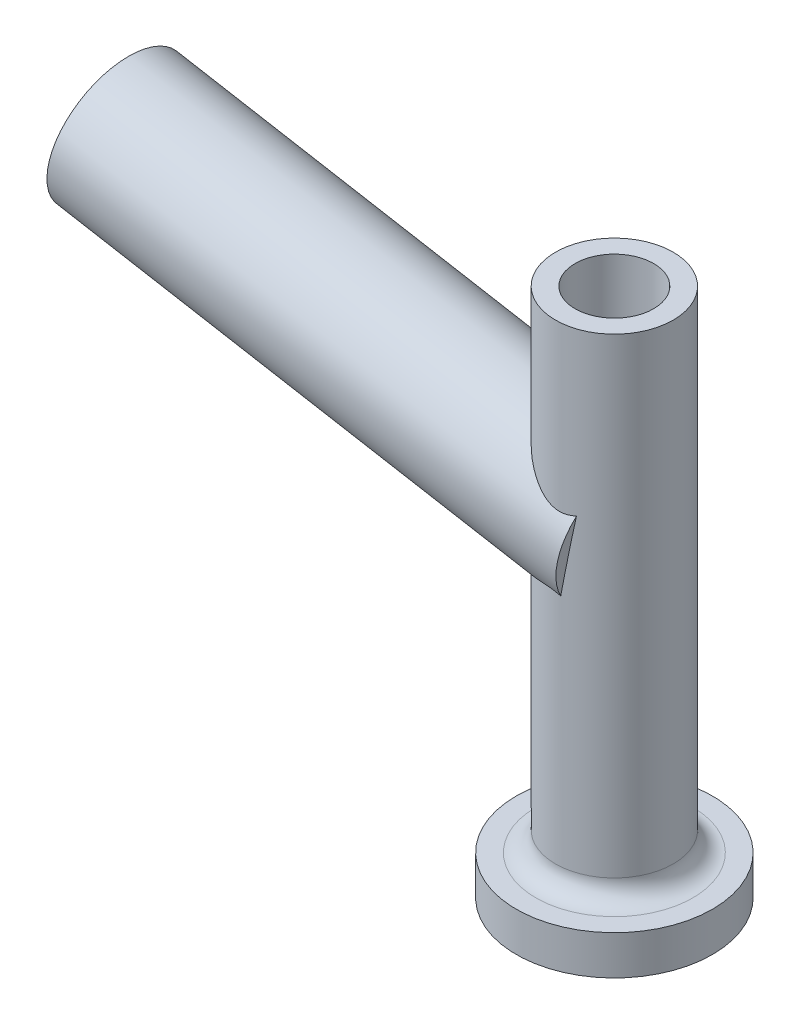
ISO-10303-21;
HEADER;
FILE_DESCRIPTION(('STEP AP214'),'2;1');
FILE_NAME('part.step','',(''),(''),'','','');
FILE_SCHEMA(('AUTOMOTIVE_DESIGN { 1 0 10303 214 1 1 1 1 }'));
ENDSEC;
DATA;
#1=APPLICATION_CONTEXT('core data for automotive mechanical design processes');
#2=APPLICATION_PROTOCOL_DEFINITION('international standard','automotive_design',2000,#1);
#3=PRODUCT_CONTEXT('',#1,'mechanical');
#4=PRODUCT('Part','Part','',(#3));
#5=PRODUCT_RELATED_PRODUCT_CATEGORY('part','',(#4));
#6=PRODUCT_DEFINITION_FORMATION('','',#4);
#7=PRODUCT_DEFINITION_CONTEXT('part definition',#1,'design');
#8=PRODUCT_DEFINITION('design','',#6,#7);
#9=PRODUCT_DEFINITION_SHAPE('','',#8);
#10=(LENGTH_UNIT() NAMED_UNIT(*) SI_UNIT(.MILLI.,.METRE.));
#11=(NAMED_UNIT(*) PLANE_ANGLE_UNIT() SI_UNIT($,.RADIAN.));
#12=(NAMED_UNIT(*) SI_UNIT($,.STERADIAN.) SOLID_ANGLE_UNIT());
#13=UNCERTAINTY_MEASURE_WITH_UNIT(LENGTH_MEASURE(1.E-05),#10,'distance_accuracy_value','');
#14=(GEOMETRIC_REPRESENTATION_CONTEXT(3) GLOBAL_UNCERTAINTY_ASSIGNED_CONTEXT((#13)) GLOBAL_UNIT_ASSIGNED_CONTEXT((#10,
#11,#12)) REPRESENTATION_CONTEXT('',''));
#15=CARTESIAN_POINT('',(0.,0.,0.));
#16=DIRECTION('',(0.,0.,1.));
#17=DIRECTION('',(1.,0.,0.));
#18=AXIS2_PLACEMENT_3D('',#15,#16,#17);
#19=CARTESIAN_POINT('',(50.,-115.,0.));
#20=DIRECTION('',(0.,1.,0.));
#21=DIRECTION('',(-1.,0.,0.));
#22=AXIS2_PLACEMENT_3D('',#19,#20,#21);
#23=PLANE('',#22);
#24=CARTESIAN_POINT('',(0.,-115.,0.));
#25=DIRECTION('',(0.,1.,0.));
#26=DIRECTION('',(-1.,0.,0.));
#27=AXIS2_PLACEMENT_3D('',#24,#25,#26);
#28=CIRCLE('',#27,40.);
#29=CARTESIAN_POINT('',(-40.,-115.,0.));
#30=VERTEX_POINT('',#29);
#31=EDGE_CURVE('E42',#30,#30,#28,.F.);
#32=ORIENTED_EDGE('',*,*,#31,.T.);
#33=EDGE_LOOP('',(#32));
#34=FACE_BOUND('',#33,.T.);
#35=CARTESIAN_POINT('',(0.,-115.,0.));
#36=DIRECTION('',(0.,-1.,0.));
#37=DIRECTION('',(1.,0.,0.));
#38=AXIS2_PLACEMENT_3D('',#35,#36,#37);
#39=CIRCLE('',#38,50.);
#40=CARTESIAN_POINT('',(50.,-115.,0.));
#41=VERTEX_POINT('',#40);
#42=EDGE_CURVE('E72',#41,#41,#39,.T.);
#43=ORIENTED_EDGE('',*,*,#42,.F.);
#44=EDGE_LOOP('',(#43));
#45=FACE_BOUND('',#44,.T.);
#46=ADVANCED_FACE('F34',(#34,#45),#23,.T.);
#47=CARTESIAN_POINT('',(0.,-135.,0.));
#48=DIRECTION('',(0.,-1.,0.));
#49=DIRECTION('',(1.,0.,0.));
#50=AXIS2_PLACEMENT_3D('',#47,#48,#49);
#51=CYLINDRICAL_SURFACE('',#50,50.);
#52=ORIENTED_EDGE('',*,*,#42,.T.);
#53=EDGE_LOOP('',(#52));
#54=FACE_BOUND('',#53,.T.);
#55=CARTESIAN_POINT('',(0.,-135.,0.));
#56=DIRECTION('',(0.,-1.,0.));
#57=DIRECTION('',(1.,0.,0.));
#58=AXIS2_PLACEMENT_3D('',#55,#56,#57);
#59=CIRCLE('',#58,50.);
#60=CARTESIAN_POINT('',(50.,-135.,0.));
#61=VERTEX_POINT('',#60);
#62=EDGE_CURVE('E89',#61,#61,#59,.T.);
#63=ORIENTED_EDGE('',*,*,#62,.F.);
#64=EDGE_LOOP('',(#63));
#65=FACE_BOUND('',#64,.T.);
#66=ADVANCED_FACE('F119',(#54,#65),#51,.T.);
#67=CARTESIAN_POINT('',(20.,-135.,0.));
#68=DIRECTION('',(0.,-1.,0.));
#69=DIRECTION('',(1.,0.,0.));
#70=AXIS2_PLACEMENT_3D('',#67,#68,#69);
#71=PLANE('',#70);
#72=ORIENTED_EDGE('',*,*,#62,.T.);
#73=EDGE_LOOP('',(#72));
#74=FACE_BOUND('',#73,.T.);
#75=CARTESIAN_POINT('',(0.,-135.,0.));
#76=DIRECTION('',(0.,-1.,0.));
#77=DIRECTION('',(1.,0.,0.));
#78=AXIS2_PLACEMENT_3D('',#75,#76,#77);
#79=CIRCLE('',#78,20.);
#80=CARTESIAN_POINT('',(20.,-135.,0.));
#81=VERTEX_POINT('',#80);
#82=EDGE_CURVE('E86',#81,#81,#79,.T.);
#83=ORIENTED_EDGE('',*,*,#82,.F.);
#84=EDGE_LOOP('',(#83));
#85=FACE_BOUND('',#84,.T.);
#86=ADVANCED_FACE('F124',(#74,#85),#71,.T.);
#87=CARTESIAN_POINT('',(0.,-135.,0.));
#88=DIRECTION('',(0.,-1.,0.));
#89=DIRECTION('',(1.,0.,0.));
#90=AXIS2_PLACEMENT_3D('',#87,#88,#89);
#91=CYLINDRICAL_SURFACE('',#90,20.);
#92=ORIENTED_EDGE('',*,*,#82,.T.);
#93=EDGE_LOOP('',(#92));
#94=FACE_BOUND('',#93,.T.);
#95=CARTESIAN_POINT('',(0.,135.,0.));
#96=DIRECTION('',(0.,-1.,0.));
#97=DIRECTION('',(1.,0.,0.));
#98=AXIS2_PLACEMENT_3D('',#95,#96,#97);
#99=CIRCLE('',#98,20.);
#100=CARTESIAN_POINT('',(20.,135.,0.));
#101=VERTEX_POINT('',#100);
#102=EDGE_CURVE('E83',#101,#101,#99,.T.);
#103=ORIENTED_EDGE('',*,*,#102,.F.);
#104=EDGE_LOOP('',(#103));
#105=FACE_BOUND('',#104,.T.);
#106=ADVANCED_FACE('F132',(#94,#105),#91,.F.);
#107=CARTESIAN_POINT('',(29.9999999999999,135.,0.));
#108=DIRECTION('',(0.,1.,0.));
#109=DIRECTION('',(-1.,0.,0.));
#110=AXIS2_PLACEMENT_3D('',#107,#108,#109);
#111=PLANE('',#110);
#112=ORIENTED_EDGE('',*,*,#102,.T.);
#113=EDGE_LOOP('',(#112));
#114=FACE_BOUND('',#113,.T.);
#115=CARTESIAN_POINT('',(0.,135.,0.));
#116=DIRECTION('',(0.,-1.,0.));
#117=DIRECTION('',(1.,0.,0.));
#118=AXIS2_PLACEMENT_3D('',#115,#116,#117);
#119=CIRCLE('',#118,30.);
#120=CARTESIAN_POINT('',(29.9999999999999,135.,0.));
#121=VERTEX_POINT('',#120);
#122=EDGE_CURVE('E80',#121,#121,#119,.T.);
#123=ORIENTED_EDGE('',*,*,#122,.F.);
#124=EDGE_LOOP('',(#123));
#125=FACE_BOUND('',#124,.T.);
#126=ADVANCED_FACE('F135',(#114,#125),#111,.T.);
#127=CARTESIAN_POINT('',(0.,-135.,0.));
#128=DIRECTION('',(0.,-1.,0.));
#129=DIRECTION('',(1.,0.,0.));
#130=AXIS2_PLACEMENT_3D('',#127,#128,#129);
#131=CYLINDRICAL_SURFACE('',#130,30.);
#132=CARTESIAN_POINT('',(0.,-105.,0.));
#133=DIRECTION('',(0.,1.,0.));
#134=DIRECTION('',(-1.,0.,0.));
#135=AXIS2_PLACEMENT_3D('',#132,#133,#134);
#136=CIRCLE('',#135,30.);
#137=CARTESIAN_POINT('',(-30.,-105.,0.));
#138=VERTEX_POINT('',#137);
#139=EDGE_CURVE('E11',#138,#138,#136,.T.);
#140=ORIENTED_EDGE('',*,*,#139,.T.);
#141=EDGE_LOOP('',(#140));
#142=FACE_BOUND('',#141,.T.);
#143=CARTESIAN_POINT('',(0.,2.19269047363468E-12,0.));
#144=DIRECTION('',(0.984807753012208,-0.173648177666931,0.));
#145=DIRECTION('',(-0.173648177666931,-0.984807753012208,0.));
#146=AXIS2_PLACEMENT_3D('',#143,#144,#145);
#147=ELLIPSE('',#146,172.763114494308,30.);
#148=CARTESIAN_POINT('',(2.55965773767558,14.5165403921261,29.8906030763173));
#149=VERTEX_POINT('',#148);
#150=CARTESIAN_POINT('',(9.23920533264113,52.3981372307253,28.5418479573641));
#151=VERTEX_POINT('',#150);
#152=EDGE_CURVE('E49',#149,#151,#147,.F.);
#153=ORIENTED_EDGE('',*,*,#152,.F.);
#154=CARTESIAN_POINT('',(2.55965773767559,14.5165403921261,-29.8906030763174));
#155=CARTESIAN_POINT('',(2.34275392169348,14.5857519527365,-29.909177651239));
#156=CARTESIAN_POINT('',(2.12456736897599,14.6515050381402,-29.9254826695436));
#157=CARTESIAN_POINT('',(1.68579412105829,14.7756972704318,-29.9534046391235));
#158=CARTESIAN_POINT('',(1.46520708638688,14.8341353678468,-29.9650209182415));
#159=CARTESIAN_POINT('',(0.800122180655471,14.9978691687799,-29.9926088052968));
#160=CARTESIAN_POINT('',(0.352364237312519,15.0915638436472,-30.0013139263609));
#161=CARTESIAN_POINT('',(-0.54455985538153,15.2447559866207,-29.9983783919114));
#162=CARTESIAN_POINT('',(-0.993673359321253,15.3045661155237,-29.986927897652));
#163=CARTESIAN_POINT('',(-1.89403704029497,15.3903300467166,-29.9435412201925));
#164=CARTESIAN_POINT('',(-2.34528662719881,15.4162927080262,-29.9116104006475));
#165=CARTESIAN_POINT('',(-3.24759427537743,15.4349801083142,-29.827151592793));
#166=CARTESIAN_POINT('',(-3.69864931647299,15.4276254758366,-29.7745746916921));
#167=CARTESIAN_POINT('',(-4.5963339099502,15.3815487663667,-29.6492694560147));
#168=CARTESIAN_POINT('',(-5.04296286722682,15.3428225277348,-29.5765384487121));
#169=CARTESIAN_POINT('',(-5.92992396512372,15.2370183332403,-29.4115599717506));
#170=CARTESIAN_POINT('',(-6.37024424267686,15.1698927694899,-29.3192798607759));
#171=CARTESIAN_POINT('',(-7.24201358936005,15.0109526417834,-29.116209670304));
#172=CARTESIAN_POINT('',(-7.6734617817988,14.9191356504543,-29.0054177713494));
#173=CARTESIAN_POINT('',(-8.7845266900506,14.6526771136064,-28.6938574838978));
#174=CARTESIAN_POINT('',(-9.45633157155368,14.4615374309695,-28.479211230583));
#175=CARTESIAN_POINT('',(-10.7723057479621,14.0397757734529,-28.007975219263));
#176=CARTESIAN_POINT('',(-11.4164574502491,13.8091291169411,-27.7513592456011));
#177=CARTESIAN_POINT('',(-12.6788905632944,13.3195009065608,-27.1978373766482));
#178=CARTESIAN_POINT('',(-13.2970738885547,13.0604233151393,-26.9007940555545));
#179=CARTESIAN_POINT('',(-14.5054856304438,12.5242062555653,-26.2689123966115));
#180=CARTESIAN_POINT('',(-15.0957166182651,12.2470684542731,-25.9340775446352));
#181=CARTESIAN_POINT('',(-16.0621670580194,11.7736171754143,-25.3419803099595));
#182=CARTESIAN_POINT('',(-16.4458980310562,11.5801320807145,-25.0946248511082));
#183=CARTESIAN_POINT('',(-17.2007083151735,11.1903008827863,-24.5833972651538));
#184=CARTESIAN_POINT('',(-17.5717868675423,10.9939546089896,-24.319524150239));
#185=CARTESIAN_POINT('',(-18.6660966289599,10.4032012479736,-23.5033066331384));
#186=CARTESIAN_POINT('',(-19.3703430545544,10.0071090093245,-22.926400188155));
#187=CARTESIAN_POINT('',(-20.7247899311287,9.22323453252023,-21.7096873739858));
#188=CARTESIAN_POINT('',(-21.3750707152271,8.83544060426625,-21.0699777093307));
#189=CARTESIAN_POINT('',(-22.6192415922099,8.07768178424971,-19.7283125107));
#190=CARTESIAN_POINT('',(-23.2131476484242,7.70771186006011,-19.0263747070671));
#191=CARTESIAN_POINT('',(-24.2425920648423,7.05625795244201,-17.6884467011286));
#192=CARTESIAN_POINT('',(-24.6877838130943,6.77051285048002,-17.0619395945014));
#193=CARTESIAN_POINT('',(-25.5328345263628,6.22247215641581,-15.7692878213312));
#194=CARTESIAN_POINT('',(-25.9326972766204,5.96017460669069,-15.1031464715777));
#195=CARTESIAN_POINT('',(-26.6831569574515,5.46389221480842,-13.7338416407554));
#196=CARTESIAN_POINT('',(-27.0337707892959,5.22989766346037,-13.0306909750058));
#197=CARTESIAN_POINT('',(-27.6818493652197,4.79467244365067,-11.5904566649133));
#198=CARTESIAN_POINT('',(-27.9793136768305,4.59344204178656,-10.8533727445225));
#199=CARTESIAN_POINT('',(-28.5190910778352,4.22658778772996,-9.34391161804887));
#200=CARTESIAN_POINT('',(-28.7609660457036,4.06124732868361,-8.57130803483635));
#201=CARTESIAN_POINT('',(-29.1828031920545,3.77194435250767,-7.0017329822543));
#202=CARTESIAN_POINT('',(-29.362764658364,3.64798231134243,-6.20476123269969));
#203=CARTESIAN_POINT('',(-29.6575019893387,3.44455469722016,-4.5937629791386));
#204=CARTESIAN_POINT('',(-29.7723199484644,3.36506039055088,-3.77974784170473));
#205=CARTESIAN_POINT('',(-29.9347495579476,3.2525126246431,-2.14189475343983));
#206=CARTESIAN_POINT('',(-29.9823704010116,3.21945281307113,-1.31805816175768));
#207=CARTESIAN_POINT('',(-30.0077643449285,3.20182761760884,0.224929415890307));
#208=CARTESIAN_POINT('',(-29.9937432387295,3.21156500700368,0.943898027768025));
#209=CARTESIAN_POINT('',(-29.9142524406048,3.26670687722616,2.37755552613848));
#210=CARTESIAN_POINT('',(-29.8487879631648,3.31210774307494,3.09224483899848));
#211=CARTESIAN_POINT('',(-29.6673872629731,3.4376658702982,4.51202281033168));
#212=CARTESIAN_POINT('',(-29.5514538693189,3.51782118346814,5.21711200466696));
#213=CARTESIAN_POINT('',(-29.2707533171613,3.71133786872866,6.61284749284651));
#214=CARTESIAN_POINT('',(-29.1059849292763,3.82470007677519,7.30349342262461));
#215=CARTESIAN_POINT('',(-28.7335609598204,4.07994718764055,8.65229326910467));
#216=CARTESIAN_POINT('',(-28.5268313059952,4.22121477068779,9.31082099009673));
#217=CARTESIAN_POINT('',(-28.0709475707518,4.53125392397726,10.6062929127118));
#218=CARTESIAN_POINT('',(-27.8217946118659,4.70002476647059,11.243237684891));
#219=CARTESIAN_POINT('',(-27.2836153930004,5.06242262085783,12.4926799968597));
#220=CARTESIAN_POINT('',(-26.9945895127262,5.25604939605035,13.1051777693835));
#221=CARTESIAN_POINT('',(-26.3792408505676,5.66531900066874,14.3034747396341));
#222=CARTESIAN_POINT('',(-26.0529158938723,5.88096311378929,14.8892723777579));
#223=CARTESIAN_POINT('',(-25.3256200131976,6.35739238272472,16.0986610825595));
#224=CARTESIAN_POINT('',(-24.9203810563456,6.62051280840613,16.7187661193767));
#225=CARTESIAN_POINT('',(-24.0697663958042,7.16617177084114,17.9217513801782));
#226=CARTESIAN_POINT('',(-23.6243877514994,7.44871172990045,18.504628871536));
#227=CARTESIAN_POINT('',(-22.6956930037855,8.02911570437736,19.6326248288753));
#228=CARTESIAN_POINT('',(-22.2123284892749,8.32699910212691,20.177693388456));
#229=CARTESIAN_POINT('',(-21.210468777782,8.93302006975861,21.2283529998026));
#230=CARTESIAN_POINT('',(-20.691972933274,9.24115782859145,21.7339433235527));
#231=CARTESIAN_POINT('',(-19.5245860839281,9.91889298787042,22.7929651256536));
#232=CARTESIAN_POINT('',(-18.8690882249983,10.2895124935988,23.3384728127331));
#233=CARTESIAN_POINT('',(-17.5129310180261,11.0285307315678,24.3726231292356));
#234=CARTESIAN_POINT('',(-16.8122560292442,11.3969286458782,24.86124589853));
#235=CARTESIAN_POINT('',(-15.7283181585322,11.9386596692356,25.5500103790876));
#236=CARTESIAN_POINT('',(-15.3615908962499,12.1173927192744,25.7721988403599));
#237=CARTESIAN_POINT('',(-14.6170170616553,12.4694830381852,26.2016702180886));
#238=CARTESIAN_POINT('',(-14.2391717497089,12.6428409118577,26.408954814975));
#239=CARTESIAN_POINT('',(-13.472516853617,12.9820535045967,26.8081694481222));
#240=CARTESIAN_POINT('',(-13.0837145461231,13.1479130212659,27.0001093644102));
#241=CARTESIAN_POINT('',(-12.2947547739345,13.4699180919555,27.3683860624108));
#242=CARTESIAN_POINT('',(-11.8945955109559,13.6260620949641,27.5447203546862));
#243=CARTESIAN_POINT('',(-11.0217377962944,13.9484896453028,27.9065740483924));
#244=CARTESIAN_POINT('',(-10.5471955670056,14.1127550650689,28.0894729479701));
#245=CARTESIAN_POINT('',(-9.58337923263311,14.4198987985196,28.4327347079322));
#246=CARTESIAN_POINT('',(-9.09411004708015,14.5627841610188,28.5931049947285));
#247=CARTESIAN_POINT('',(-8.10256871923214,14.8213559375595,28.8897119271294));
#248=CARTESIAN_POINT('',(-7.60033171649036,14.9371087252985,29.0260072608322));
#249=CARTESIAN_POINT('',(-6.58327215973041,15.1358221897546,29.2734385441179));
#250=CARTESIAN_POINT('',(-6.06845214570717,15.2187894274221,29.3845795256138));
#251=CARTESIAN_POINT('',(-5.1065050021965,15.3365129156905,29.5656243358989));
#252=CARTESIAN_POINT('',(-4.66072817048052,15.3766125691506,29.6392057230148));
#253=CARTESIAN_POINT('',(-3.76456840993162,15.4256507193608,29.7663022500651));
#254=CARTESIAN_POINT('',(-3.31418568407967,15.4345905834329,29.8198182703955));
#255=CARTESIAN_POINT('',(-2.41200664055168,15.4191973287807,29.9063127064611));
#256=CARTESIAN_POINT('',(-1.96021039973206,15.3948659887728,29.9392922199642));
#257=CARTESIAN_POINT('',(-1.05883473537718,15.3123006683053,29.9847043628817));
#258=CARTESIAN_POINT('',(-0.609254727401835,15.2540761678498,29.9971427339751));
#259=CARTESIAN_POINT('',(0.299369607931564,15.1021662412201,30.0020588311388));
#260=CARTESIAN_POINT('',(0.758232384978755,15.0073673478396,29.9938599288144));
#261=CARTESIAN_POINT('',(1.43949713700399,14.8408322410306,29.9663066346198));
#262=CARTESIAN_POINT('',(1.66530391723962,14.7812998469639,29.9545892694805));
#263=CARTESIAN_POINT('',(2.11440697382146,14.6545649002411,29.9262405977777));
#264=CARTESIAN_POINT('',(2.33770364181606,14.587363562929,29.9096100691712));
#265=CARTESIAN_POINT('',(2.5596577376756,14.5165403921262,29.8906030763174));
#266=B_SPLINE_CURVE_WITH_KNOTS('',3,(#154,#155,#156,#157,#158,#159,#160,#161,#162,#163,#164,
#165,#166,#167,#168,#169,#170,#171,#172,#173,#174,#175,#176,#177,#178,#179,#180,#181,#182,#183,
#184,#185,#186,#187,#188,#189,#190,#191,#192,#193,#194,#195,#196,#197,#198,#199,#200,#201,#202,
#203,#204,#205,#206,#207,#208,#209,#210,#211,#212,#213,#214,#215,#216,#217,#218,#219,#220,#221,
#222,#223,#224,#225,#226,#227,#228,#229,#230,#231,#232,#233,#234,#235,#236,#237,#238,#239,#240,
#241,#242,#243,#244,#245,#246,#247,#248,#249,#250,#251,#252,#253,#254,#255,#256,#257,#258,#259,
#260,#261,#262,#263,#264,#265),.UNSPECIFIED.,.F.,.F.,(4,2,2,2,2,2,2,2,2,2,2,2,2,2,2,2,2,2,2,2,2,
2,2,2,2,2,2,2,2,2,2,2,2,2,2,2,2,2,2,2,2,2,2,2,2,2,2,2,2,2,2,2,2,2,2,4),(0.,0.685227009348743,
1.37055221501409,2.74140359172464,4.09939069160032,5.45702228921461,6.81788985759053,
8.17893798313023,9.54227683172569,10.9057497569132,13.0942878866035,15.2841983065214,
17.481748077243,19.679095312404,21.1662269048878,22.6534475180049,25.6281132712166,
28.598268401993,31.5675799650997,34.0251570410057,36.482528743183,38.9390550519535,
41.3956013481543,43.8708911028824,46.3462093291935,48.8199262262208,51.2933046807689,
53.4481374680815,55.602751861936,57.7572454917653,59.911793363841,62.0231511612824,
64.1344531002947,66.2457349350105,68.3571399358695,70.7132003132994,73.0694334351674,
75.4287197367701,77.7880495355631,80.5747563573012,83.3624331976543,84.7557413731275,
86.1488922041363,87.5411386747085,88.9336068401283,90.5359218465396,92.1377074144269,
93.7355327009772,95.3330380731783,96.6923844166576,98.0516711099392,99.4108851370484,
100.76971917105,102.173681197421,102.874969138705,103.576146096557),.UNSPECIFIED.);
#267=CARTESIAN_POINT('',(2.55965773767563,14.5165403921259,-29.8906030763174));
#268=VERTEX_POINT('',#267);
#269=EDGE_CURVE('E58',#268,#149,#266,.T.);
#270=ORIENTED_EDGE('',*,*,#269,.F.);
#271=CARTESIAN_POINT('',(9.23920533264125,52.3981372307255,-28.5418479573641));
#272=VERTEX_POINT('',#271);
#273=EDGE_CURVE('E62',#272,#268,#147,.F.);
#274=ORIENTED_EDGE('',*,*,#273,.F.);
#275=CARTESIAN_POINT('',(9.23920533264113,52.3981372307253,28.5418479573641));
#276=CARTESIAN_POINT('',(8.76370408059655,52.2617576464604,28.6958069958628));
#277=CARTESIAN_POINT('',(8.28102742971449,52.1367910964454,28.8388882610756));
#278=CARTESIAN_POINT('',(7.30216228373871,51.9150394060664,29.1021524387992));
#279=CARTESIAN_POINT('',(6.80595024342402,51.8183073186031,29.2222920992105));
#280=CARTESIAN_POINT('',(5.80377901372933,51.659111483574,29.437700481372));
#281=CARTESIAN_POINT('',(5.29784446712587,51.5965705586241,29.5330249596165));
#282=CARTESIAN_POINT('',(4.2787287995579,51.5106381633374,29.6977883449844));
#283=CARTESIAN_POINT('',(3.765552636357,51.4872211055952,29.767244147365));
#284=CARTESIAN_POINT('',(2.73014739229742,51.48322535333,29.8801020990964));
#285=CARTESIAN_POINT('',(2.20788190680717,51.5031397868471,29.9231971095118));
#286=CARTESIAN_POINT('',(1.16543790113158,51.5883452387974,29.9819004489295));
#287=CARTESIAN_POINT('',(0.645259677011408,51.6536424805395,29.9975050071501));
#288=CARTESIAN_POINT('',(-0.386499130689904,51.8280786591537,30.0019370236399));
#289=CARTESIAN_POINT('',(-0.898096851484263,51.9371155996838,29.990826479748));
#290=CARTESIAN_POINT('',(-1.90981806245332,52.1952559714693,29.9434342890656));
#291=CARTESIAN_POINT('',(-2.40993991222978,52.3443650925231,29.9071490665962));
#292=CARTESIAN_POINT('',(-3.50582754863454,52.7145111915879,29.8006047991304));
#293=CARTESIAN_POINT('',(-4.09810619795222,52.9441706681221,29.7245816944904));
#294=CARTESIAN_POINT('',(-5.25960318105297,53.4452224667156,29.5412033374433));
#295=CARTESIAN_POINT('',(-5.8288132538639,53.7166295748475,29.4338369718136));
#296=CARTESIAN_POINT('',(-6.94719306250397,54.2930451065045,29.1901655493375));
#297=CARTESIAN_POINT('',(-7.49624375742992,54.5982202532933,29.0537135152935));
#298=CARTESIAN_POINT('',(-8.57254309884268,55.2328868977037,28.7545392603123));
#299=CARTESIAN_POINT('',(-9.09979172618292,55.5623784166792,28.5918170163052));
#300=CARTESIAN_POINT('',(-10.0805595679807,56.2040620414564,28.259896642532));
#301=CARTESIAN_POINT('',(-10.5360553745471,56.5145058789084,28.0931191131619));
#302=CARTESIAN_POINT('',(-11.432181606728,57.1459785272438,27.7405317074104));
#303=CARTESIAN_POINT('',(-11.8728096339994,57.4670090295184,27.5547187797285));
#304=CARTESIAN_POINT('',(-12.7404294459553,58.1167061964567,27.1644594128182));
#305=CARTESIAN_POINT('',(-13.1674121687546,58.4453776951692,26.9600009245714));
#306=CARTESIAN_POINT('',(-14.0082474806461,59.1075457444567,26.5328352558352));
#307=CARTESIAN_POINT('',(-14.4221007516434,59.4410420431317,26.3101290252394));
#308=CARTESIAN_POINT('',(-15.2372739695695,60.1106334235347,25.8465722810213));
#309=CARTESIAN_POINT('',(-15.6385950141005,60.4467282744405,25.6057233627186));
#310=CARTESIAN_POINT('',(-16.4291427936187,61.1196086607623,25.1058156781757));
#311=CARTESIAN_POINT('',(-16.8183693235322,61.4563942077867,24.8467566034078));
#312=CARTESIAN_POINT('',(-17.5847644729624,62.1287623190847,24.3103831123651));
#313=CARTESIAN_POINT('',(-17.961937944135,62.4643453178612,24.0330761823928));
#314=CARTESIAN_POINT('',(-18.7043530254597,63.1327793307835,23.4599033675921));
#315=CARTESIAN_POINT('',(-19.0695949721445,63.4656304217849,23.1640380068994));
#316=CARTESIAN_POINT('',(-20.0517889679521,64.3699042663152,22.3292291528228));
#317=CARTESIAN_POINT('',(-20.6566920180144,64.9370885515492,21.7712843227368));
#318=CARTESIAN_POINT('',(-21.8279561750693,66.0504173663818,20.5968011652505));
#319=CARTESIAN_POINT('',(-22.3943131562399,66.596559641019,19.9802565824327));
#320=CARTESIAN_POINT('',(-23.4834796168738,67.6581830329144,18.6879232909384));
#321=CARTESIAN_POINT('',(-24.0063775054366,68.1737257559207,18.0122608985528));
#322=CARTESIAN_POINT('',(-24.7544580018525,68.9175162465991,16.9529798033313));
#323=CARTESIAN_POINT('',(-24.9977458392885,69.1604974924806,16.5923024464631));
#324=CARTESIAN_POINT('',(-25.4714994873381,69.635466355051,15.8554290024075));
#325=CARTESIAN_POINT('',(-25.7019623417379,69.8674514352645,15.4792293717844));
#326=CARTESIAN_POINT('',(-26.2425325842488,70.4134309482782,14.5508211020034));
#327=CARTESIAN_POINT('',(-26.5456482946688,70.7211563799546,13.9907910428408));
#328=CARTESIAN_POINT('',(-27.1207835254389,71.3073307234456,12.8404239082038));
#329=CARTESIAN_POINT('',(-27.3928115422678,71.5857876328695,12.2500951777878));
#330=CARTESIAN_POINT('',(-27.9023452853015,72.1090305351113,11.0403670648118));
#331=CARTESIAN_POINT('',(-28.1398580606019,72.3538234026337,10.4209736524531));
#332=CARTESIAN_POINT('',(-28.5767268495443,72.8052203237361,9.15526184185239));
#333=CARTESIAN_POINT('',(-28.7760822202953,73.0118237338832,8.50894299018344));
#334=CARTESIAN_POINT('',(-29.134818967988,73.3843093144038,7.18588330146691));
#335=CARTESIAN_POINT('',(-29.2937573639322,73.5497398326265,6.50889380430533));
#336=CARTESIAN_POINT('',(-29.565402868466,73.8328507804403,5.1358155840719));
#337=CARTESIAN_POINT('',(-29.6781100849466,73.9505313214668,4.43972690557634));
#338=CARTESIAN_POINT('',(-29.8544348684401,74.1347691168545,3.03530432570846));
#339=CARTESIAN_POINT('',(-29.918099033566,74.2013748994737,2.32698270346989));
#340=CARTESIAN_POINT('',(-29.9948086139681,74.2816400842746,0.904657328092223));
#341=CARTESIAN_POINT('',(-30.0078620589632,74.29530788541,0.190654494328183));
#342=CARTESIAN_POINT('',(-29.9849080222502,74.2712839176779,-1.12815848437581));
#343=CARTESIAN_POINT('',(-29.9559795403584,74.2410027573391,-1.7332508530464));
#344=CARTESIAN_POINT('',(-29.8619483833434,74.1426469691389,-2.93745561827001));
#345=CARTESIAN_POINT('',(-29.7968500690688,74.0745768973326,-3.5365687268555));
#346=CARTESIAN_POINT('',(-29.6316882116895,73.9020704542276,-4.72471676309677));
#347=CARTESIAN_POINT('',(-29.5316182217538,73.7976273777832,-5.31374981153488));
#348=CARTESIAN_POINT('',(-29.2982654383311,73.5544526642052,-6.47797561551863));
#349=CARTESIAN_POINT('',(-29.1649809404926,73.4157192675194,-7.05316765917297));
#350=CARTESIAN_POINT('',(-28.8679138531018,73.107114828949,-8.18438880080729));
#351=CARTESIAN_POINT('',(-28.7042553791105,72.9373705478193,-8.74048534318024));
#352=CARTESIAN_POINT('',(-28.3483782129874,72.5691418234497,-9.83360952584352));
#353=CARTESIAN_POINT('',(-28.1561605553437,72.3706584212224,-10.3706378559616));
#354=CARTESIAN_POINT('',(-27.7454858117,71.947804524322,-11.4239929889794));
#355=CARTESIAN_POINT('',(-27.5270290115283,71.7234343116401,-11.9403200173007));
#356=CARTESIAN_POINT('',(-27.0660631493861,71.2515711687056,-12.9513309591979));
#357=CARTESIAN_POINT('',(-26.8235486504664,71.0040730123613,-13.4460099438277));
#358=CARTESIAN_POINT('',(-26.3711300740348,70.5441459538252,-14.30898810765));
#359=CARTESIAN_POINT('',(-26.1654252039997,70.3356179786855,-14.6815921495217));
#360=CARTESIAN_POINT('',(-25.7414838124343,69.9073106013333,-15.4128059398731));
#361=CARTESIAN_POINT('',(-25.5232492871369,69.6875329920218,-15.7714179023732));
#362=CARTESIAN_POINT('',(-24.8507619489901,69.012837559038,-16.8266364393161));
#363=CARTESIAN_POINT('',(-24.3788390026721,68.5426730054073,-17.5024107082924));
#364=CARTESIAN_POINT('',(-23.3923569937542,67.5691866568173,-18.8006586130226));
#365=CARTESIAN_POINT('',(-22.8776651633252,67.0657626868772,-19.4229530713882));
#366=CARTESIAN_POINT('',(-21.8112067809065,66.0349085933302,-20.6133395187487));
#367=CARTESIAN_POINT('',(-21.2594433400706,65.5074804854136,-21.1814360465272));
#368=CARTESIAN_POINT('',(-20.3161289947046,64.618964346577,-22.0799076848206));
#369=CARTESIAN_POINT('',(-19.934215600739,64.2625829990213,-22.4252104393879));
#370=CARTESIAN_POINT('',(-19.156023850974,63.5445196446652,-23.0935019722264));
#371=CARTESIAN_POINT('',(-18.7597445715267,63.1828372979333,-23.4164893118452));
#372=CARTESIAN_POINT('',(-17.9528911583839,62.4560241354085,-24.0406742977643));
#373=CARTESIAN_POINT('',(-17.5423087649528,62.0908914188515,-24.3418590338846));
#374=CARTESIAN_POINT('',(-16.7070716614772,61.359501983298,-24.9225291223328));
#375=CARTESIAN_POINT('',(-16.2824173697972,60.993245298011,-25.2020151189502));
#376=CARTESIAN_POINT('',(-15.4195220932511,60.2625302873959,-25.7390001344831));
#377=CARTESIAN_POINT('',(-14.9813067148484,59.8980699189334,-25.9965375112772));
#378=CARTESIAN_POINT('',(-14.0899800326665,59.172806528203,-26.4902254566303));
#379=CARTESIAN_POINT('',(-13.6368677650753,58.8120037445603,-26.7263746376711));
#380=CARTESIAN_POINT('',(-12.7153046800021,58.0973317166977,-27.1768999157052));
#381=CARTESIAN_POINT('',(-12.2468670428051,57.743456912247,-27.391294103843));
#382=CARTESIAN_POINT('',(-11.2932270919909,57.0459192910657,-27.798052405665));
#383=CARTESIAN_POINT('',(-10.8080281098474,56.7022544699766,-27.9904208647464));
#384=CARTESIAN_POINT('',(-9.85578538960218,56.0541916536579,-28.3390413922439));
#385=CARTESIAN_POINT('',(-9.39003656415388,55.7487658418668,-28.4969099891688));
#386=CARTESIAN_POINT('',(-8.44162839337044,55.1546114680435,-28.7921092453582));
#387=CARTESIAN_POINT('',(-7.95896992272447,54.8658820443951,-28.9294409650081));
#388=CARTESIAN_POINT('',(-6.97616971034732,54.3106892489376,-29.1820174969311));
#389=CARTESIAN_POINT('',(-6.47605141083124,54.0441975360462,-29.2972906721006));
#390=CARTESIAN_POINT('',(-5.45695339935727,53.5393733186639,-29.5040987354277));
#391=CARTESIAN_POINT('',(-4.93797677704085,53.3010362284346,-29.5956374922847));
#392=CARTESIAN_POINT('',(-3.97145968064006,52.8974333513473,-29.7392617948301));
#393=CARTESIAN_POINT('',(-3.52684247239858,52.7266387013661,-29.7954143315805));
#394=CARTESIAN_POINT('',(-2.62556807286216,52.4137902055152,-29.8883174929525));
#395=CARTESIAN_POINT('',(-2.16891212386976,52.2717334071473,-29.9250701113274));
#396=CARTESIAN_POINT('',(-1.24627999694134,52.0207344489323,-29.9776549010157));
#397=CARTESIAN_POINT('',(-0.780323739600594,51.9117282272185,-29.9935277456304));
#398=CARTESIAN_POINT('',(0.158825480951175,51.7297021585302,-30.0032533341428));
#399=CARTESIAN_POINT('',(0.632017984625705,51.6566800360964,-29.9971074705999));
#400=CARTESIAN_POINT('',(1.58381587787388,51.5480869485473,-29.9619626001591));
#401=CARTESIAN_POINT('',(2.0624354716696,51.5126699163779,-29.9328705046867));
#402=CARTESIAN_POINT('',(3.01903261079811,51.4795483086647,-29.8515646112693));
#403=CARTESIAN_POINT('',(3.49701008184829,51.481847774014,-29.799348336415));
#404=CARTESIAN_POINT('',(4.44951204229,51.5220303652134,-29.6720968099137));
#405=CARTESIAN_POINT('',(4.92402537816709,51.5599995781586,-29.5970066496892));
#406=CARTESIAN_POINT('',(5.86520057072085,51.668018128889,-29.4249604761822));
#407=CARTESIAN_POINT('',(6.33186386720738,51.7380615158068,-29.3280085207109));
#408=CARTESIAN_POINT('',(7.21097158997708,51.8978244015102,-29.1236266619869));
#409=CARTESIAN_POINT('',(7.62432861571527,51.9850173182788,-29.0180892631533));
#410=CARTESIAN_POINT('',(8.43979676673813,52.1782637813755,-28.7914590758404));
#411=CARTESIAN_POINT('',(8.84195624371817,52.2842138770557,-28.6704525720928));
#412=CARTESIAN_POINT('',(9.23920533264113,52.3981372307252,-28.5418479573642));
#413=B_SPLINE_CURVE_WITH_KNOTS('',3,(#275,#276,#277,#278,#279,#280,#281,#282,#283,#284,#285,
#286,#287,#288,#289,#290,#291,#292,#293,#294,#295,#296,#297,#298,#299,#300,#301,#302,#303,#304,
#305,#306,#307,#308,#309,#310,#311,#312,#313,#314,#315,#316,#317,#318,#319,#320,#321,#322,#323,
#324,#325,#326,#327,#328,#329,#330,#331,#332,#333,#334,#335,#336,#337,#338,#339,#340,#341,#342,
#343,#344,#345,#346,#347,#348,#349,#350,#351,#352,#353,#354,#355,#356,#357,#358,#359,#360,#361,
#362,#363,#364,#365,#366,#367,#368,#369,#370,#371,#372,#373,#374,#375,#376,#377,#378,#379,#380,
#381,#382,#383,#384,#385,#386,#387,#388,#389,#390,#391,#392,#393,#394,#395,#396,#397,#398,#399,
#400,#401,#402,#403,#404,#405,#406,#407,#408,#409,#410,#411,#412),.UNSPECIFIED.,.F.,.F.,(4,2,2,
2,2,2,2,2,2,2,2,2,2,2,2,2,2,2,2,2,2,2,2,2,2,2,2,2,2,2,2,2,2,2,2,2,2,2,2,2,2,2,2,2,2,2,2,2,2,2,2,
2,2,2,2,2,2,2,2,2,2,2,2,2,2,2,2,2,4),(0.,1.55447151518897,3.111845370548,4.66568920297795,
6.21851640743008,7.78910768624712,9.35991438152037,10.9270792194631,12.4944666948405,
14.410705993032,16.3276255494992,18.2544716957658,20.1813195341527,21.9083922246793,
23.635742192731,25.3642164167286,27.0926007214122,28.8208332231258,30.5490950126732,
32.2766521394387,34.0041604977114,36.9998295474582,39.9958187393784,42.985555864158,
44.4800535936818,45.9748943964919,48.0947862585345,50.2140973469951,52.332974995463,
54.4518883404663,56.5931114512205,58.7343295649185,60.8735106884845,63.0123524032036,
64.8297252116817,66.646878954489,68.4643678561799,70.2819500387354,72.0922624314134,
73.9025092658335,75.7127363826618,77.5233735400644,78.9447182678145,80.3658371710201,
83.2088800653104,86.0611043147189,88.9130894957112,90.7910928055041,92.6692170755225,
94.5484445109203,96.4276161260217,98.3034332739706,100.179372024939,102.05373776214,
103.927733071232,105.663702628681,107.399582521428,109.133215195773,110.86656511088,
112.30411054739,113.741508216832,115.176101703005,116.610604460822,118.050956848,
119.49146355354,120.935455803553,122.37918025159,123.684649228813,124.983130609734),.UNSPECIFIED.);
#414=EDGE_CURVE('E54',#151,#272,#413,.T.);
#415=ORIENTED_EDGE('',*,*,#414,.F.);
#416=EDGE_LOOP('',(#153,#270,#274,#415));
#417=FACE_BOUND('',#416,.T.);
#418=ORIENTED_EDGE('',*,*,#122,.T.);
#419=EDGE_LOOP('',(#418));
#420=FACE_BOUND('',#419,.T.);
#421=ADVANCED_FACE('F60',(#142,#417,#420),#131,.T.);
#422=CARTESIAN_POINT('',(5.72154190778925,32.4484766018283,0.));
#423=DIRECTION('',(0.984807753012208,-0.173648177666931,0.));
#424=DIRECTION('',(0.173648177666931,0.984807753012208,0.));
#425=AXIS2_PLACEMENT_3D('',#422,#423,#424);
#426=PLANE('',#425);
#427=CARTESIAN_POINT('',(5.72154190778925,32.4484766018283,0.));
#428=DIRECTION('',(0.984807753012208,-0.173648177666931,0.));
#429=DIRECTION('',(0.173648177666931,0.984807753012208,0.));
#430=AXIS2_PLACEMENT_3D('',#427,#428,#429);
#431=CIRCLE('',#430,34.9999999999999);
#432=EDGE_CURVE('E71',#268,#272,#431,.T.);
#433=ORIENTED_EDGE('',*,*,#432,.T.);
#434=ORIENTED_EDGE('',*,*,#273,.T.);
#435=EDGE_LOOP('',(#433,#434));
#436=FACE_BOUND('',#435,.T.);
#437=ADVANCED_FACE('F70',(#436),#426,.T.);
#438=CARTESIAN_POINT('',(-253.643101034664,78.1814609944003,0.));
#439=DIRECTION('',(0.984807753012208,-0.173648177666931,0.));
#440=DIRECTION('',(0.173648177666931,0.984807753012208,0.));
#441=AXIS2_PLACEMENT_3D('',#438,#439,#440);
#442=PLANE('',#441);
#443=CARTESIAN_POINT('',(-253.643101034664,78.1814609944003,0.));
#444=DIRECTION('',(0.984807753012208,-0.173648177666931,0.));
#445=DIRECTION('',(0.173648177666931,0.984807753012208,0.));
#446=AXIS2_PLACEMENT_3D('',#443,#444,#445);
#447=CIRCLE('',#446,34.9999999999999);
#448=CARTESIAN_POINT('',(-247.565414816322,112.649732349827,0.));
#449=VERTEX_POINT('',#448);
#450=EDGE_CURVE('E77',#449,#449,#447,.T.);
#451=ORIENTED_EDGE('',*,*,#450,.F.);
#452=EDGE_LOOP('',(#451));
#453=FACE_BOUND('',#452,.T.);
#454=ADVANCED_FACE('F108',(#453),#442,.F.);
#455=CARTESIAN_POINT('',(-253.643101034664,78.1814609944003,0.));
#456=DIRECTION('',(0.984807753012208,-0.173648177666931,0.));
#457=DIRECTION('',(0.173648177666931,0.984807753012208,0.));
#458=AXIS2_PLACEMENT_3D('',#455,#456,#457);
#459=CYLINDRICAL_SURFACE('',#458,34.9999999999999);
#460=ORIENTED_EDGE('',*,*,#450,.T.);
#461=EDGE_LOOP('',(#460));
#462=FACE_BOUND('',#461,.T.);
#463=ORIENTED_EDGE('',*,*,#432,.F.);
#464=ORIENTED_EDGE('',*,*,#269,.T.);
#465=EDGE_CURVE('E75',#151,#149,#431,.T.);
#466=ORIENTED_EDGE('',*,*,#465,.F.);
#467=ORIENTED_EDGE('',*,*,#414,.T.);
#468=EDGE_LOOP('',(#463,#464,#466,#467));
#469=FACE_BOUND('',#468,.T.);
#470=ADVANCED_FACE('F74',(#462,#469),#459,.T.);
#471=ORIENTED_EDGE('',*,*,#465,.T.);
#472=ORIENTED_EDGE('',*,*,#152,.T.);
#473=EDGE_LOOP('',(#471,#472));
#474=FACE_BOUND('',#473,.T.);
#475=ADVANCED_FACE('F107',(#474),#426,.T.);
#476=CARTESIAN_POINT('',(0.,-105.,0.));
#477=DIRECTION('',(0.,1.,0.));
#478=DIRECTION('',(-1.,0.,0.));
#479=AXIS2_PLACEMENT_3D('',#476,#477,#478);
#480=TOROIDAL_SURFACE('',#479,40.,10.);
#481=ORIENTED_EDGE('',*,*,#139,.F.);
#482=EDGE_LOOP('',(#481));
#483=FACE_BOUND('',#482,.T.);
#484=ORIENTED_EDGE('',*,*,#31,.F.);
#485=EDGE_LOOP('',(#484));
#486=FACE_BOUND('',#485,.T.);
#487=ADVANCED_FACE('F36',(#483,#486),#480,.F.);
#488=CLOSED_SHELL('',(#46,#66,#86,#106,#126,#421,#437,#454,#470,#475,#487));
#489=MANIFOLD_SOLID_BREP('B2',#488);
#490=ADVANCED_BREP_SHAPE_REPRESENTATION('',(#18,#489),#14);
#491=SHAPE_DEFINITION_REPRESENTATION(#9,#490);
ENDSEC;
END-ISO-10303-21;
